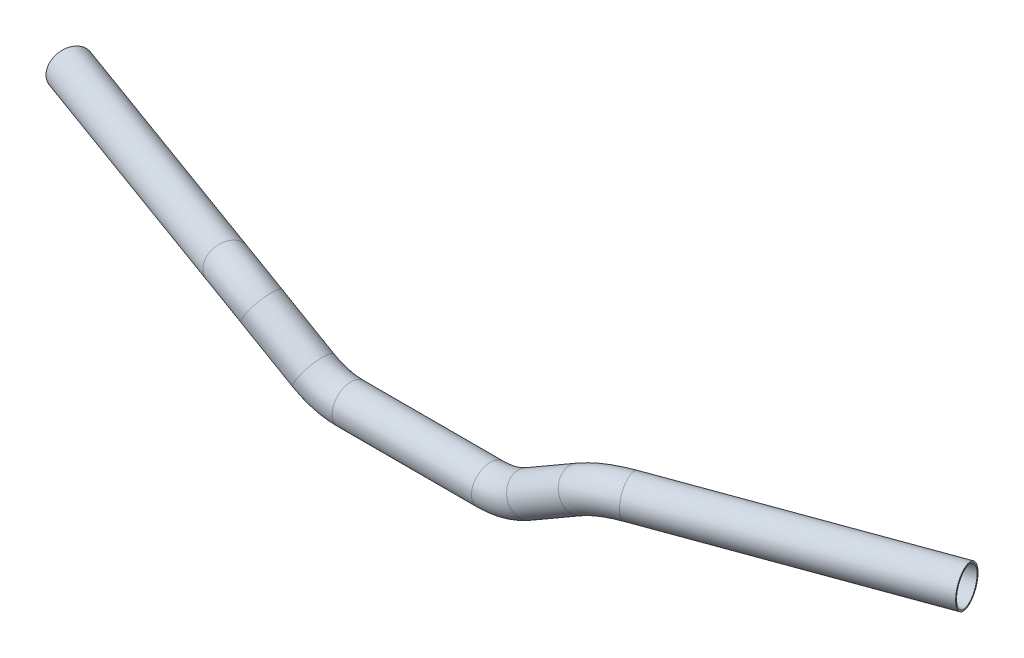
ISO-10303-21;
HEADER;
FILE_DESCRIPTION(('STEP AP214'),'2;1');
FILE_NAME('part.step','',(''),(''),'','','');
FILE_SCHEMA(('AUTOMOTIVE_DESIGN { 1 0 10303 214 1 1 1 1 }'));
ENDSEC;
DATA;
#1=APPLICATION_CONTEXT('core data for automotive mechanical design processes');
#2=APPLICATION_PROTOCOL_DEFINITION('international standard','automotive_design',2000,#1);
#3=PRODUCT_CONTEXT('',#1,'mechanical');
#4=PRODUCT('Part','Part','',(#3));
#5=PRODUCT_RELATED_PRODUCT_CATEGORY('part','',(#4));
#6=PRODUCT_DEFINITION_FORMATION('','',#4);
#7=PRODUCT_DEFINITION_CONTEXT('part definition',#1,'design');
#8=PRODUCT_DEFINITION('design','',#6,#7);
#9=PRODUCT_DEFINITION_SHAPE('','',#8);
#10=(LENGTH_UNIT() NAMED_UNIT(*) SI_UNIT(.MILLI.,.METRE.));
#11=(NAMED_UNIT(*) PLANE_ANGLE_UNIT() SI_UNIT($,.RADIAN.));
#12=(NAMED_UNIT(*) SI_UNIT($,.STERADIAN.) SOLID_ANGLE_UNIT());
#13=UNCERTAINTY_MEASURE_WITH_UNIT(LENGTH_MEASURE(1.E-05),#10,'distance_accuracy_value','');
#14=(GEOMETRIC_REPRESENTATION_CONTEXT(3) GLOBAL_UNCERTAINTY_ASSIGNED_CONTEXT((#13)) GLOBAL_UNIT_ASSIGNED_CONTEXT((#10,
#11,#12)) REPRESENTATION_CONTEXT('',''));
#15=CARTESIAN_POINT('',(0.,0.,0.));
#16=DIRECTION('',(0.,0.,1.));
#17=DIRECTION('',(1.,0.,0.));
#18=AXIS2_PLACEMENT_3D('',#15,#16,#17);
#19=CARTESIAN_POINT('',(-135.054070373708,34.6410161513771,-5.47923352057852));
#20=DIRECTION('',(-0.939692620785908,0.,-0.34202014332567));
#21=DIRECTION('',(-0.34202014332567,0.,0.939692620785908));
#22=AXIS2_PLACEMENT_3D('',#19,#20,#21);
#23=CYLINDRICAL_SURFACE('',#22,12.5);
#24=CARTESIAN_POINT('',(-135.054070373708,34.6410161513771,-5.47923352057852));
#25=DIRECTION('',(0.939692620785908,0.,0.34202014332567));
#26=DIRECTION('',(0.340496596682072,-0.094282881393701,-0.935506710785138));
#27=AXIS2_PLACEMENT_3D('',#24,#25,#26);
#28=CIRCLE('',#27,12.5);
#29=CARTESIAN_POINT('',(-137.233069471741,45.3955862294272,0.507517298278227));
#30=VERTEX_POINT('',#29);
#31=EDGE_CURVE('E34',#30,#30,#28,.T.);
#32=ORIENTED_EDGE('',*,*,#31,.F.);
#33=EDGE_LOOP('',(#32));
#34=FACE_BOUND('',#33,.T.);
#35=CARTESIAN_POINT('',(-299.933342618238,34.6410161513771,-65.4903808650611));
#36=DIRECTION('',(0.939692620785908,0.,0.34202014332567));
#37=DIRECTION('',(0.340496596682072,-0.094282881393701,-0.935506710785138));
#38=AXIS2_PLACEMENT_3D('',#35,#36,#37);
#39=CIRCLE('',#38,12.5);
#40=CARTESIAN_POINT('',(-295.677135159712,33.4624801339558,-77.1842147498753));
#41=VERTEX_POINT('',#40);
#42=EDGE_CURVE('E10',#41,#41,#39,.T.);
#43=ORIENTED_EDGE('',*,*,#42,.T.);
#44=EDGE_LOOP('',(#43));
#45=FACE_BOUND('',#44,.T.);
#46=ADVANCED_FACE('F24',(#34,#45),#23,.T.);
#47=CARTESIAN_POINT('',(-135.054070373708,34.6410161513771,-5.47923352057852));
#48=DIRECTION('',(-0.939692620785908,0.,-0.34202014332567));
#49=DIRECTION('',(-0.34202014332567,0.,0.939692620785908));
#50=AXIS2_PLACEMENT_3D('',#47,#48,#49);
#51=CYLINDRICAL_SURFACE('',#50,11.5);
#52=CARTESIAN_POINT('',(-135.054070373708,34.6410161513771,-5.47923352057852));
#53=DIRECTION('',(0.939692620785908,0.,0.34202014332567));
#54=DIRECTION('',(0.340496596682072,-0.094282881393701,-0.935506710785138));
#55=AXIS2_PLACEMENT_3D('',#52,#53,#54);
#56=CIRCLE('',#55,11.5);
#57=CARTESIAN_POINT('',(-137.058749543898,44.5352206231832,0.0285772327696873));
#58=VERTEX_POINT('',#57);
#59=EDGE_CURVE('E38',#58,#58,#56,.T.);
#60=ORIENTED_EDGE('',*,*,#59,.T.);
#61=EDGE_LOOP('',(#60));
#62=FACE_BOUND('',#61,.T.);
#63=CARTESIAN_POINT('',(-299.933342618238,34.6410161513771,-65.4903808650611));
#64=DIRECTION('',(0.939692620785908,0.,0.34202014332567));
#65=DIRECTION('',(0.340496596682072,-0.094282881393701,-0.935506710785138));
#66=AXIS2_PLACEMENT_3D('',#63,#64,#65);
#67=CIRCLE('',#66,11.5);
#68=CARTESIAN_POINT('',(-296.017631756394,33.5567630153495,-76.2487080390902));
#69=VERTEX_POINT('',#68);
#70=EDGE_CURVE('E30',#69,#69,#67,.T.);
#71=ORIENTED_EDGE('',*,*,#70,.F.);
#72=EDGE_LOOP('',(#71));
#73=FACE_BOUND('',#72,.T.);
#74=ADVANCED_FACE('F139',(#62,#73),#51,.F.);
#75=CARTESIAN_POINT('',(-126.338073981578,-8.37726416082336,-29.4262367960056));
#76=DIRECTION('',(-0.294262367960052,-0.509677372062346,0.808479211365489));
#77=DIRECTION('',(0.,-0.845933175701257,-0.533288910674117));
#78=AXIS2_PLACEMENT_3D('',#75,#76,#77);
#79=TOROIDAL_SURFACE('',#78,50.,12.5);
#80=CARTESIAN_POINT('',(-106.126093697441,26.6309126128829,0.));
#81=DIRECTION('',(0.866025403784442,-0.499999999999995,0.));
#82=DIRECTION('',(0.,0.,-1.));
#83=AXIS2_PLACEMENT_3D('',#80,#81,#82);
#84=CIRCLE('',#83,12.5);
#85=CARTESIAN_POINT('',(-101.073098626406,35.3829568063094,7.35655919900138));
#86=VERTEX_POINT('',#85);
#87=EDGE_CURVE('E43',#86,#86,#84,.T.);
#88=CARTESIAN_POINT('',(-126.338073981578,-8.37726416082336,-29.4262367960056));
#89=DIRECTION('',(-0.294262367960052,-0.509677372062346,0.808479211365489));
#90=DIRECTION('',(0.,-0.845933175701257,-0.533288910674117));
#91=AXIS2_PLACEMENT_3D('',#88,#89,#90);
#92=CIRCLE('',#91,62.5);
#93=EDGE_CURVE('',#86,#30,#92,.T.);
#94=ORIENTED_EDGE('',*,*,#87,.F.);
#95=ORIENTED_EDGE('',*,*,#31,.T.);
#96=ORIENTED_EDGE('',*,*,#93,.T.);
#97=ORIENTED_EDGE('',*,*,#93,.F.);
#98=EDGE_LOOP('',(#94,#96,#95,#97));
#99=FACE_BOUND('',#98,.T.);
#100=ADVANCED_FACE('F144',(#99),#79,.T.);
#101=CARTESIAN_POINT('',(-126.338073981578,-8.37726416082336,-29.4262367960056));
#102=DIRECTION('',(-0.294262367960052,-0.509677372062346,0.808479211365489));
#103=DIRECTION('',(0.,-0.845933175701257,-0.533288910674117));
#104=AXIS2_PLACEMENT_3D('',#101,#102,#103);
#105=TOROIDAL_SURFACE('',#104,50.,11.5);
#106=CARTESIAN_POINT('',(-106.126093697441,26.6309126128829,0.));
#107=DIRECTION('',(0.866025403784442,-0.499999999999995,0.));
#108=DIRECTION('',(0.,0.,-1.));
#109=AXIS2_PLACEMENT_3D('',#106,#107,#108);
#110=CIRCLE('',#109,11.5);
#111=CARTESIAN_POINT('',(-101.477338232089,34.6827932708353,6.76803446308127));
#112=VERTEX_POINT('',#111);
#113=EDGE_CURVE('E46',#112,#112,#110,.T.);
#114=CARTESIAN_POINT('',(-126.338073981578,-8.37726416082336,-29.4262367960056));
#115=DIRECTION('',(-0.294262367960052,-0.509677372062346,0.808479211365489));
#116=DIRECTION('',(0.,-0.845933175701257,-0.533288910674117));
#117=AXIS2_PLACEMENT_3D('',#114,#115,#116);
#118=CIRCLE('',#117,61.5);
#119=EDGE_CURVE('',#112,#58,#118,.T.);
#120=ORIENTED_EDGE('',*,*,#113,.T.);
#121=ORIENTED_EDGE('',*,*,#59,.F.);
#122=ORIENTED_EDGE('',*,*,#119,.T.);
#123=ORIENTED_EDGE('',*,*,#119,.F.);
#124=EDGE_LOOP('',(#120,#122,#121,#123));
#125=FACE_BOUND('',#124,.T.);
#126=ADVANCED_FACE('F149',(#125),#105,.F.);
#127=CARTESIAN_POINT('',(-71.6025403784437,6.69872981077792,0.));
#128=DIRECTION('',(-0.866025403784442,0.499999999999995,0.));
#129=DIRECTION('',(-0.499999999999995,-0.866025403784442,0.));
#130=AXIS2_PLACEMENT_3D('',#127,#128,#129);
#131=CYLINDRICAL_SURFACE('',#130,12.5);
#132=CARTESIAN_POINT('',(-71.6025403784437,6.69872981077792,0.));
#133=DIRECTION('',(0.866025403784442,-0.499999999999995,0.));
#134=DIRECTION('',(0.,0.,-1.));
#135=AXIS2_PLACEMENT_3D('',#132,#133,#134);
#136=CIRCLE('',#135,12.5);
#137=CARTESIAN_POINT('',(-77.8525403784437,-4.1265877365276,0.));
#138=VERTEX_POINT('',#137);
#139=EDGE_CURVE('E49',#138,#138,#136,.T.);
#140=ORIENTED_EDGE('',*,*,#139,.F.);
#141=EDGE_LOOP('',(#140));
#142=FACE_BOUND('',#141,.T.);
#143=ORIENTED_EDGE('',*,*,#87,.T.);
#144=EDGE_LOOP('',(#143));
#145=FACE_BOUND('',#144,.T.);
#146=ADVANCED_FACE('F155',(#142,#145),#131,.T.);
#147=CARTESIAN_POINT('',(-71.6025403784437,6.69872981077792,0.));
#148=DIRECTION('',(-0.866025403784442,0.499999999999995,0.));
#149=DIRECTION('',(-0.499999999999995,-0.866025403784442,0.));
#150=AXIS2_PLACEMENT_3D('',#147,#148,#149);
#151=CYLINDRICAL_SURFACE('',#150,11.5);
#152=CARTESIAN_POINT('',(-71.6025403784437,6.69872981077792,0.));
#153=DIRECTION('',(0.866025403784442,-0.499999999999995,0.));
#154=DIRECTION('',(0.,0.,-1.));
#155=AXIS2_PLACEMENT_3D('',#152,#153,#154);
#156=CIRCLE('',#155,11.5);
#157=CARTESIAN_POINT('',(-77.3525403784437,-3.26056233274316,0.));
#158=VERTEX_POINT('',#157);
#159=EDGE_CURVE('E52',#158,#158,#156,.T.);
#160=ORIENTED_EDGE('',*,*,#159,.T.);
#161=EDGE_LOOP('',(#160));
#162=FACE_BOUND('',#161,.T.);
#163=ORIENTED_EDGE('',*,*,#113,.F.);
#164=EDGE_LOOP('',(#163));
#165=FACE_BOUND('',#164,.T.);
#166=ADVANCED_FACE('F162',(#162,#165),#151,.F.);
#167=CARTESIAN_POINT('',(-46.602540378444,50.,0.));
#168=DIRECTION('',(0.,0.,-1.));
#169=DIRECTION('',(0.,1.,0.));
#170=AXIS2_PLACEMENT_3D('',#167,#168,#169);
#171=TOROIDAL_SURFACE('',#170,50.,12.5);
#172=CARTESIAN_POINT('',(-46.602540378444,0.,0.));
#173=DIRECTION('',(1.,0.,0.));
#174=DIRECTION('',(0.,0.,-1.));
#175=AXIS2_PLACEMENT_3D('',#172,#173,#174);
#176=CIRCLE('',#175,12.5);
#177=CARTESIAN_POINT('',(-46.602540378444,-12.5,0.));
#178=VERTEX_POINT('',#177);
#179=EDGE_CURVE('E55',#178,#178,#176,.T.);
#180=CARTESIAN_POINT('',(-46.602540378444,50.,0.));
#181=DIRECTION('',(0.,0.,-1.));
#182=DIRECTION('',(0.,1.,0.));
#183=AXIS2_PLACEMENT_3D('',#180,#181,#182);
#184=CIRCLE('',#183,62.5);
#185=EDGE_CURVE('',#178,#138,#184,.T.);
#186=ORIENTED_EDGE('',*,*,#179,.F.);
#187=ORIENTED_EDGE('',*,*,#139,.T.);
#188=ORIENTED_EDGE('',*,*,#185,.T.);
#189=ORIENTED_EDGE('',*,*,#185,.F.);
#190=EDGE_LOOP('',(#186,#188,#187,#189));
#191=FACE_BOUND('',#190,.T.);
#192=ADVANCED_FACE('F166',(#191),#171,.T.);
#193=CARTESIAN_POINT('',(-46.602540378444,50.,0.));
#194=DIRECTION('',(0.,0.,-1.));
#195=DIRECTION('',(0.,1.,0.));
#196=AXIS2_PLACEMENT_3D('',#193,#194,#195);
#197=TOROIDAL_SURFACE('',#196,50.,11.5);
#198=CARTESIAN_POINT('',(-46.602540378444,0.,0.));
#199=DIRECTION('',(1.,0.,0.));
#200=DIRECTION('',(0.,0.,-1.));
#201=AXIS2_PLACEMENT_3D('',#198,#199,#200);
#202=CIRCLE('',#201,11.5);
#203=CARTESIAN_POINT('',(-46.602540378444,-11.5,0.));
#204=VERTEX_POINT('',#203);
#205=EDGE_CURVE('E58',#204,#204,#202,.T.);
#206=CARTESIAN_POINT('',(-46.602540378444,50.,0.));
#207=DIRECTION('',(0.,0.,-1.));
#208=DIRECTION('',(0.,1.,0.));
#209=AXIS2_PLACEMENT_3D('',#206,#207,#208);
#210=CIRCLE('',#209,61.5);
#211=EDGE_CURVE('',#204,#158,#210,.T.);
#212=ORIENTED_EDGE('',*,*,#205,.T.);
#213=ORIENTED_EDGE('',*,*,#159,.F.);
#214=ORIENTED_EDGE('',*,*,#211,.T.);
#215=ORIENTED_EDGE('',*,*,#211,.F.);
#216=EDGE_LOOP('',(#212,#214,#213,#215));
#217=FACE_BOUND('',#216,.T.);
#218=ADVANCED_FACE('F170',(#217),#197,.F.);
#219=CARTESIAN_POINT('',(-46.602540378444,0.,0.));
#220=DIRECTION('',(1.,0.,0.));
#221=DIRECTION('',(0.,0.,-1.));
#222=AXIS2_PLACEMENT_3D('',#219,#220,#221);
#223=CYLINDRICAL_SURFACE('',#222,11.5);
#224=ORIENTED_EDGE('',*,*,#205,.F.);
#225=EDGE_LOOP('',(#224));
#226=FACE_BOUND('',#225,.T.);
#227=CARTESIAN_POINT('',(46.602540378444,0.,0.));
#228=DIRECTION('',(1.,0.,0.));
#229=DIRECTION('',(0.,0.,-1.));
#230=AXIS2_PLACEMENT_3D('',#227,#228,#229);
#231=CIRCLE('',#230,11.5);
#232=CARTESIAN_POINT('',(46.602540378444,-11.5,0.));
#233=VERTEX_POINT('',#232);
#234=EDGE_CURVE('E88',#233,#233,#231,.T.);
#235=ORIENTED_EDGE('',*,*,#234,.T.);
#236=EDGE_LOOP('',(#235));
#237=FACE_BOUND('',#236,.T.);
#238=ADVANCED_FACE('F92',(#226,#237),#223,.F.);
#239=CARTESIAN_POINT('',(-46.602540378444,0.,0.));
#240=DIRECTION('',(1.,0.,0.));
#241=DIRECTION('',(0.,0.,-1.));
#242=AXIS2_PLACEMENT_3D('',#239,#240,#241);
#243=CYLINDRICAL_SURFACE('',#242,12.5);
#244=ORIENTED_EDGE('',*,*,#179,.T.);
#245=EDGE_LOOP('',(#244));
#246=FACE_BOUND('',#245,.T.);
#247=CARTESIAN_POINT('',(46.602540378444,0.,0.));
#248=DIRECTION('',(1.,0.,0.));
#249=DIRECTION('',(0.,0.,-1.));
#250=AXIS2_PLACEMENT_3D('',#247,#248,#249);
#251=CIRCLE('',#250,12.5);
#252=CARTESIAN_POINT('',(46.602540378444,-12.5,0.));
#253=VERTEX_POINT('',#252);
#254=EDGE_CURVE('E85',#253,#253,#251,.T.);
#255=ORIENTED_EDGE('',*,*,#254,.F.);
#256=EDGE_LOOP('',(#255));
#257=FACE_BOUND('',#256,.T.);
#258=ADVANCED_FACE('F136',(#246,#257),#243,.T.);
#259=CARTESIAN_POINT('',(-299.933342618238,34.6410161513771,-65.4903808650611));
#260=DIRECTION('',(0.939692620785908,0.,0.34202014332567));
#261=DIRECTION('',(0.340496596682072,-0.094282881393701,-0.935506710785138));
#262=AXIS2_PLACEMENT_3D('',#259,#260,#261);
#263=PLANE('',#262);
#264=ORIENTED_EDGE('',*,*,#70,.T.);
#265=EDGE_LOOP('',(#264));
#266=FACE_BOUND('',#265,.T.);
#267=ORIENTED_EDGE('',*,*,#42,.F.);
#268=EDGE_LOOP('',(#267));
#269=FACE_BOUND('',#268,.T.);
#270=ADVANCED_FACE('F129',(#266,#269),#263,.F.);
#271=CARTESIAN_POINT('',(135.054070373708,34.6410161513771,-5.47923352057852));
#272=DIRECTION('',(0.939692620785908,0.,-0.34202014332567));
#273=DIRECTION('',(-0.34202014332567,0.,-0.939692620785908));
#274=AXIS2_PLACEMENT_3D('',#271,#272,#273);
#275=CYLINDRICAL_SURFACE('',#274,12.5);
#276=CARTESIAN_POINT('',(135.054070373708,34.6410161513771,-5.47923352057852));
#277=DIRECTION('',(0.939692620785908,0.,-0.34202014332567));
#278=DIRECTION('',(-0.340496596682072,-0.094282881393701,-0.935506710785138));
#279=AXIS2_PLACEMENT_3D('',#276,#277,#278);
#280=CIRCLE('',#279,12.5);
#281=CARTESIAN_POINT('',(137.233069471741,45.3955862294272,0.507517298278227));
#282=VERTEX_POINT('',#281);
#283=EDGE_CURVE('E67',#282,#282,#280,.T.);
#284=ORIENTED_EDGE('',*,*,#283,.T.);
#285=EDGE_LOOP('',(#284));
#286=FACE_BOUND('',#285,.T.);
#287=CARTESIAN_POINT('',(299.933342618238,34.6410161513771,-65.4903808650611));
#288=DIRECTION('',(0.939692620785908,0.,-0.34202014332567));
#289=DIRECTION('',(-0.340496596682072,-0.094282881393701,-0.935506710785138));
#290=AXIS2_PLACEMENT_3D('',#287,#288,#289);
#291=CIRCLE('',#290,12.5);
#292=CARTESIAN_POINT('',(295.677135159712,33.4624801339558,-77.1842147498753));
#293=VERTEX_POINT('',#292);
#294=EDGE_CURVE('E61',#293,#293,#291,.T.);
#295=ORIENTED_EDGE('',*,*,#294,.F.);
#296=EDGE_LOOP('',(#295));
#297=FACE_BOUND('',#296,.T.);
#298=ADVANCED_FACE('F119',(#286,#297),#275,.T.);
#299=CARTESIAN_POINT('',(135.054070373708,34.6410161513771,-5.47923352057852));
#300=DIRECTION('',(0.939692620785908,0.,-0.34202014332567));
#301=DIRECTION('',(-0.34202014332567,0.,-0.939692620785908));
#302=AXIS2_PLACEMENT_3D('',#299,#300,#301);
#303=CYLINDRICAL_SURFACE('',#302,11.5);
#304=CARTESIAN_POINT('',(135.054070373708,34.6410161513771,-5.47923352057852));
#305=DIRECTION('',(0.939692620785908,0.,-0.34202014332567));
#306=DIRECTION('',(-0.340496596682072,-0.094282881393701,-0.935506710785138));
#307=AXIS2_PLACEMENT_3D('',#304,#305,#306);
#308=CIRCLE('',#307,11.5);
#309=CARTESIAN_POINT('',(137.058749543898,44.5352206231832,0.0285772327696873));
#310=VERTEX_POINT('',#309);
#311=EDGE_CURVE('E70',#310,#310,#308,.T.);
#312=ORIENTED_EDGE('',*,*,#311,.F.);
#313=EDGE_LOOP('',(#312));
#314=FACE_BOUND('',#313,.T.);
#315=CARTESIAN_POINT('',(299.933342618238,34.6410161513771,-65.4903808650611));
#316=DIRECTION('',(0.939692620785908,0.,-0.34202014332567));
#317=DIRECTION('',(-0.340496596682072,-0.094282881393701,-0.935506710785138));
#318=AXIS2_PLACEMENT_3D('',#315,#316,#317);
#319=CIRCLE('',#318,11.5);
#320=CARTESIAN_POINT('',(296.017631756394,33.5567630153495,-76.2487080390902));
#321=VERTEX_POINT('',#320);
#322=EDGE_CURVE('E64',#321,#321,#319,.T.);
#323=ORIENTED_EDGE('',*,*,#322,.T.);
#324=EDGE_LOOP('',(#323));
#325=FACE_BOUND('',#324,.T.);
#326=ADVANCED_FACE('F116',(#314,#325),#303,.F.);
#327=CARTESIAN_POINT('',(126.338073981578,-8.37726416082336,-29.4262367960056));
#328=DIRECTION('',(-0.294262367960052,0.509677372062346,-0.808479211365489));
#329=DIRECTION('',(0.,0.845933175701257,0.533288910674117));
#330=AXIS2_PLACEMENT_3D('',#327,#328,#329);
#331=TOROIDAL_SURFACE('',#330,50.,12.5);
#332=CARTESIAN_POINT('',(106.126093697441,26.6309126128829,0.));
#333=DIRECTION('',(0.866025403784442,0.499999999999995,0.));
#334=DIRECTION('',(0.,0.,-1.));
#335=AXIS2_PLACEMENT_3D('',#332,#333,#334);
#336=CIRCLE('',#335,12.5);
#337=CARTESIAN_POINT('',(101.073098626406,35.3829568063094,7.35655919900138));
#338=VERTEX_POINT('',#337);
#339=EDGE_CURVE('E73',#338,#338,#336,.T.);
#340=CARTESIAN_POINT('',(126.338073981578,-8.37726416082336,-29.4262367960056));
#341=DIRECTION('',(-0.294262367960052,0.509677372062346,-0.808479211365489));
#342=DIRECTION('',(0.,0.845933175701257,0.533288910674117));
#343=AXIS2_PLACEMENT_3D('',#340,#341,#342);
#344=CIRCLE('',#343,62.5);
#345=EDGE_CURVE('',#338,#282,#344,.T.);
#346=ORIENTED_EDGE('',*,*,#339,.T.);
#347=ORIENTED_EDGE('',*,*,#283,.F.);
#348=ORIENTED_EDGE('',*,*,#345,.T.);
#349=ORIENTED_EDGE('',*,*,#345,.F.);
#350=EDGE_LOOP('',(#346,#348,#347,#349));
#351=FACE_BOUND('',#350,.T.);
#352=ADVANCED_FACE('F112',(#351),#331,.T.);
#353=CARTESIAN_POINT('',(126.338073981578,-8.37726416082336,-29.4262367960056));
#354=DIRECTION('',(-0.294262367960052,0.509677372062346,-0.808479211365489));
#355=DIRECTION('',(0.,0.845933175701257,0.533288910674117));
#356=AXIS2_PLACEMENT_3D('',#353,#354,#355);
#357=TOROIDAL_SURFACE('',#356,50.,11.5);
#358=CARTESIAN_POINT('',(106.126093697441,26.6309126128829,0.));
#359=DIRECTION('',(0.866025403784442,0.499999999999995,0.));
#360=DIRECTION('',(0.,0.,-1.));
#361=AXIS2_PLACEMENT_3D('',#358,#359,#360);
#362=CIRCLE('',#361,11.5);
#363=CARTESIAN_POINT('',(101.477338232089,34.6827932708353,6.76803446308127));
#364=VERTEX_POINT('',#363);
#365=EDGE_CURVE('E76',#364,#364,#362,.T.);
#366=CARTESIAN_POINT('',(126.338073981578,-8.37726416082336,-29.4262367960056));
#367=DIRECTION('',(-0.294262367960052,0.509677372062346,-0.808479211365489));
#368=DIRECTION('',(0.,0.845933175701257,0.533288910674117));
#369=AXIS2_PLACEMENT_3D('',#366,#367,#368);
#370=CIRCLE('',#369,61.5);
#371=EDGE_CURVE('',#364,#310,#370,.T.);
#372=ORIENTED_EDGE('',*,*,#365,.F.);
#373=ORIENTED_EDGE('',*,*,#311,.T.);
#374=ORIENTED_EDGE('',*,*,#371,.T.);
#375=ORIENTED_EDGE('',*,*,#371,.F.);
#376=EDGE_LOOP('',(#372,#374,#373,#375));
#377=FACE_BOUND('',#376,.T.);
#378=ADVANCED_FACE('F109',(#377),#357,.F.);
#379=CARTESIAN_POINT('',(71.6025403784437,6.69872981077792,0.));
#380=DIRECTION('',(0.866025403784442,0.499999999999995,0.));
#381=DIRECTION('',(-0.499999999999995,0.866025403784442,0.));
#382=AXIS2_PLACEMENT_3D('',#379,#380,#381);
#383=CYLINDRICAL_SURFACE('',#382,12.5);
#384=CARTESIAN_POINT('',(71.6025403784437,6.69872981077792,0.));
#385=DIRECTION('',(0.866025403784442,0.499999999999995,0.));
#386=DIRECTION('',(0.,0.,-1.));
#387=AXIS2_PLACEMENT_3D('',#384,#385,#386);
#388=CIRCLE('',#387,12.5);
#389=CARTESIAN_POINT('',(77.8525403784437,-4.1265877365276,0.));
#390=VERTEX_POINT('',#389);
#391=EDGE_CURVE('E79',#390,#390,#388,.T.);
#392=ORIENTED_EDGE('',*,*,#391,.T.);
#393=EDGE_LOOP('',(#392));
#394=FACE_BOUND('',#393,.T.);
#395=ORIENTED_EDGE('',*,*,#339,.F.);
#396=EDGE_LOOP('',(#395));
#397=FACE_BOUND('',#396,.T.);
#398=ADVANCED_FACE('F105',(#394,#397),#383,.T.);
#399=CARTESIAN_POINT('',(71.6025403784437,6.69872981077792,0.));
#400=DIRECTION('',(0.866025403784442,0.499999999999995,0.));
#401=DIRECTION('',(-0.499999999999995,0.866025403784442,0.));
#402=AXIS2_PLACEMENT_3D('',#399,#400,#401);
#403=CYLINDRICAL_SURFACE('',#402,11.5);
#404=CARTESIAN_POINT('',(71.6025403784437,6.69872981077792,0.));
#405=DIRECTION('',(0.866025403784442,0.499999999999995,0.));
#406=DIRECTION('',(0.,0.,-1.));
#407=AXIS2_PLACEMENT_3D('',#404,#405,#406);
#408=CIRCLE('',#407,11.5);
#409=CARTESIAN_POINT('',(77.3525403784437,-3.26056233274316,0.));
#410=VERTEX_POINT('',#409);
#411=EDGE_CURVE('E82',#410,#410,#408,.T.);
#412=ORIENTED_EDGE('',*,*,#411,.F.);
#413=EDGE_LOOP('',(#412));
#414=FACE_BOUND('',#413,.T.);
#415=ORIENTED_EDGE('',*,*,#365,.T.);
#416=EDGE_LOOP('',(#415));
#417=FACE_BOUND('',#416,.T.);
#418=ADVANCED_FACE('F102',(#414,#417),#403,.F.);
#419=CARTESIAN_POINT('',(46.602540378444,50.,0.));
#420=DIRECTION('',(0.,0.,1.));
#421=DIRECTION('',(0.,-1.,0.));
#422=AXIS2_PLACEMENT_3D('',#419,#420,#421);
#423=TOROIDAL_SURFACE('',#422,50.,12.5);
#424=CARTESIAN_POINT('',(46.602540378444,50.,0.));
#425=DIRECTION('',(0.,0.,1.));
#426=DIRECTION('',(0.,-1.,0.));
#427=AXIS2_PLACEMENT_3D('',#424,#425,#426);
#428=CIRCLE('',#427,62.5);
#429=EDGE_CURVE('',#253,#390,#428,.T.);
#430=ORIENTED_EDGE('',*,*,#254,.T.);
#431=ORIENTED_EDGE('',*,*,#391,.F.);
#432=ORIENTED_EDGE('',*,*,#429,.T.);
#433=ORIENTED_EDGE('',*,*,#429,.F.);
#434=EDGE_LOOP('',(#430,#432,#431,#433));
#435=FACE_BOUND('',#434,.T.);
#436=ADVANCED_FACE('F98',(#435),#423,.T.);
#437=CARTESIAN_POINT('',(46.602540378444,50.,0.));
#438=DIRECTION('',(0.,0.,1.));
#439=DIRECTION('',(0.,-1.,0.));
#440=AXIS2_PLACEMENT_3D('',#437,#438,#439);
#441=TOROIDAL_SURFACE('',#440,50.,11.5);
#442=CARTESIAN_POINT('',(46.602540378444,50.,0.));
#443=DIRECTION('',(0.,0.,1.));
#444=DIRECTION('',(0.,-1.,0.));
#445=AXIS2_PLACEMENT_3D('',#442,#443,#444);
#446=CIRCLE('',#445,61.5);
#447=EDGE_CURVE('',#233,#410,#446,.T.);
#448=ORIENTED_EDGE('',*,*,#234,.F.);
#449=ORIENTED_EDGE('',*,*,#411,.T.);
#450=ORIENTED_EDGE('',*,*,#447,.T.);
#451=ORIENTED_EDGE('',*,*,#447,.F.);
#452=EDGE_LOOP('',(#448,#450,#449,#451));
#453=FACE_BOUND('',#452,.T.);
#454=ADVANCED_FACE('F94',(#453),#441,.F.);
#455=CARTESIAN_POINT('',(299.933342618238,34.6410161513771,-65.4903808650611));
#456=DIRECTION('',(-0.939692620785908,0.,0.34202014332567));
#457=DIRECTION('',(-0.340496596682072,-0.094282881393701,-0.935506710785138));
#458=AXIS2_PLACEMENT_3D('',#455,#456,#457);
#459=PLANE('',#458);
#460=ORIENTED_EDGE('',*,*,#322,.F.);
#461=EDGE_LOOP('',(#460));
#462=FACE_BOUND('',#461,.T.);
#463=ORIENTED_EDGE('',*,*,#294,.T.);
#464=EDGE_LOOP('',(#463));
#465=FACE_BOUND('',#464,.T.);
#466=ADVANCED_FACE('F97',(#462,#465),#459,.F.);
#467=CLOSED_SHELL('',(#46,#74,#100,#126,#146,#166,#192,#218,#238,#258,#270,#298,#326,#352,#378,
#398,#418,#436,#454,#466));
#468=MANIFOLD_SOLID_BREP('B2',#467);
#469=ADVANCED_BREP_SHAPE_REPRESENTATION('',(#18,#468),#14);
#470=SHAPE_DEFINITION_REPRESENTATION(#9,#469);
ENDSEC;
END-ISO-10303-21;
